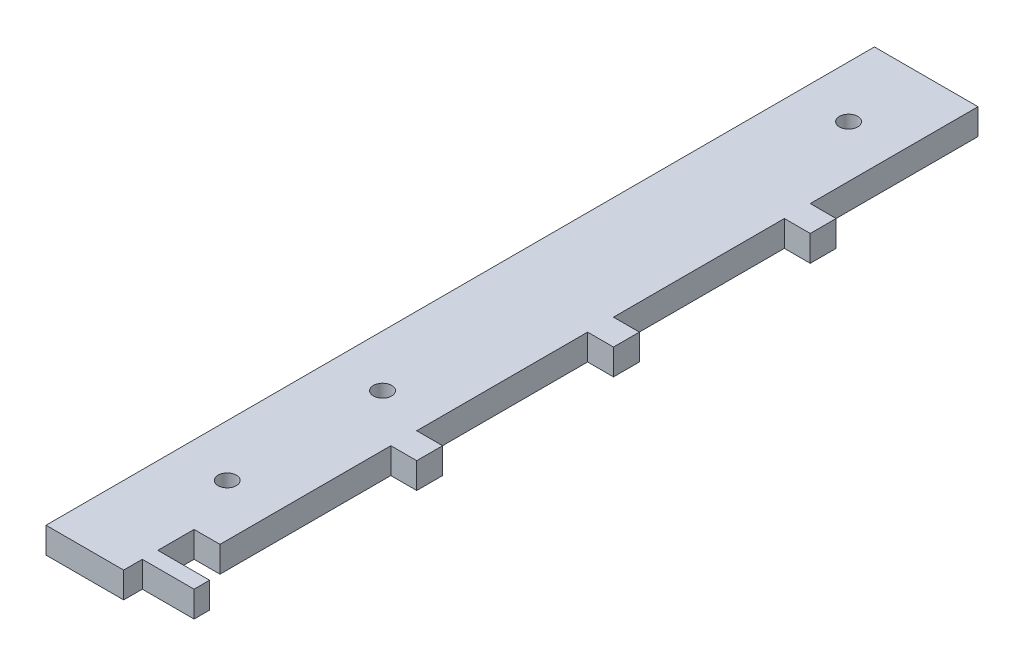
ISO-10303-21;
HEADER;
FILE_DESCRIPTION(('STEP AP214'),'2;1');
FILE_NAME('part.step','',(''),(''),'','','');
FILE_SCHEMA(('AUTOMOTIVE_DESIGN { 1 0 10303 214 1 1 1 1 }'));
ENDSEC;
DATA;
#1=APPLICATION_CONTEXT('core data for automotive mechanical design processes');
#2=APPLICATION_PROTOCOL_DEFINITION('international standard','automotive_design',2000,#1);
#3=PRODUCT_CONTEXT('',#1,'mechanical');
#4=PRODUCT('Part','Part','',(#3));
#5=PRODUCT_RELATED_PRODUCT_CATEGORY('part','',(#4));
#6=PRODUCT_DEFINITION_FORMATION('','',#4);
#7=PRODUCT_DEFINITION_CONTEXT('part definition',#1,'design');
#8=PRODUCT_DEFINITION('design','',#6,#7);
#9=PRODUCT_DEFINITION_SHAPE('','',#8);
#10=(LENGTH_UNIT() NAMED_UNIT(*) SI_UNIT(.MILLI.,.METRE.));
#11=(NAMED_UNIT(*) PLANE_ANGLE_UNIT() SI_UNIT($,.RADIAN.));
#12=(NAMED_UNIT(*) SI_UNIT($,.STERADIAN.) SOLID_ANGLE_UNIT());
#13=UNCERTAINTY_MEASURE_WITH_UNIT(LENGTH_MEASURE(1.E-05),#10,'distance_accuracy_value','');
#14=(GEOMETRIC_REPRESENTATION_CONTEXT(3) GLOBAL_UNCERTAINTY_ASSIGNED_CONTEXT((#13)) GLOBAL_UNIT_ASSIGNED_CONTEXT((#10,
#11,#12)) REPRESENTATION_CONTEXT('',''));
#15=CARTESIAN_POINT('',(0.,0.,0.));
#16=DIRECTION('',(0.,0.,1.));
#17=DIRECTION('',(1.,0.,0.));
#18=AXIS2_PLACEMENT_3D('',#15,#16,#17);
#19=CARTESIAN_POINT('',(0.,6.35,0.));
#20=DIRECTION('',(0.,0.,-1.));
#21=DIRECTION('',(-1.,0.,0.));
#22=AXIS2_PLACEMENT_3D('',#19,#20,#21);
#23=PLANE('',#22);
#24=DIRECTION('',(0.,1.,0.));
#25=VECTOR('',#24,1.);
#26=CARTESIAN_POINT('',(19.05,0.,0.));
#27=LINE('',#26,#25);
#28=CARTESIAN_POINT('',(19.05,0.,0.));
#29=VERTEX_POINT('',#28);
#30=CARTESIAN_POINT('',(19.05,6.35,0.));
#31=VERTEX_POINT('',#30);
#32=EDGE_CURVE('E182',#29,#31,#27,.T.);
#33=ORIENTED_EDGE('',*,*,#32,.T.);
#34=DIRECTION('',(1.,0.,0.));
#35=VECTOR('',#34,1.);
#36=CARTESIAN_POINT('',(0.,6.35,0.));
#37=LINE('',#36,#35);
#38=CARTESIAN_POINT('',(0.,6.35,0.));
#39=VERTEX_POINT('',#38);
#40=EDGE_CURVE('E233',#39,#31,#37,.T.);
#41=ORIENTED_EDGE('',*,*,#40,.F.);
#42=DIRECTION('',(0.,-1.,0.));
#43=VECTOR('',#42,1.);
#44=CARTESIAN_POINT('',(0.,6.35,0.));
#45=LINE('',#44,#43);
#46=CARTESIAN_POINT('',(0.,0.,0.));
#47=VERTEX_POINT('',#46);
#48=EDGE_CURVE('E11',#39,#47,#45,.T.);
#49=ORIENTED_EDGE('',*,*,#48,.T.);
#50=DIRECTION('',(1.,0.,0.));
#51=VECTOR('',#50,1.);
#52=CARTESIAN_POINT('',(0.,0.,0.));
#53=LINE('',#52,#51);
#54=EDGE_CURVE('E198',#47,#29,#53,.T.);
#55=ORIENTED_EDGE('',*,*,#54,.T.);
#56=EDGE_LOOP('',(#33,#41,#49,#55));
#57=FACE_BOUND('',#56,.T.);
#58=ADVANCED_FACE('F33',(#57),#23,.F.);
#59=CARTESIAN_POINT('',(31.75,6.35,0.));
#60=DIRECTION('',(-1.,0.,0.));
#61=DIRECTION('',(0.,0.,1.));
#62=AXIS2_PLACEMENT_3D('',#59,#60,#61);
#63=PLANE('',#62);
#64=DIRECTION('',(0.,1.,0.));
#65=VECTOR('',#64,1.);
#66=CARTESIAN_POINT('',(31.75,0.,-113.792));
#67=LINE('',#66,#65);
#68=CARTESIAN_POINT('',(31.75,0.,-113.792));
#69=VERTEX_POINT('',#68);
#70=CARTESIAN_POINT('',(31.75,6.35,-113.792));
#71=VERTEX_POINT('',#70);
#72=EDGE_CURVE('E344',#69,#71,#67,.T.);
#73=ORIENTED_EDGE('',*,*,#72,.T.);
#74=DIRECTION('',(0.,0.,-1.));
#75=VECTOR('',#74,1.);
#76=CARTESIAN_POINT('',(31.75,6.35,0.));
#77=LINE('',#76,#75);
#78=CARTESIAN_POINT('',(31.75,6.35,-107.442));
#79=VERTEX_POINT('',#78);
#80=EDGE_CURVE('E232',#79,#71,#77,.T.);
#81=ORIENTED_EDGE('',*,*,#80,.F.);
#82=DIRECTION('',(0.,1.,0.));
#83=VECTOR('',#82,1.);
#84=CARTESIAN_POINT('',(31.75,0.,-107.442));
#85=LINE('',#84,#83);
#86=CARTESIAN_POINT('',(31.75,0.,-107.442));
#87=VERTEX_POINT('',#86);
#88=EDGE_CURVE('E268',#87,#79,#85,.T.);
#89=ORIENTED_EDGE('',*,*,#88,.F.);
#90=DIRECTION('',(0.,0.,-1.));
#91=VECTOR('',#90,1.);
#92=CARTESIAN_POINT('',(31.75,0.,0.));
#93=LINE('',#92,#91);
#94=EDGE_CURVE('E208',#87,#69,#93,.T.);
#95=ORIENTED_EDGE('',*,*,#94,.T.);
#96=EDGE_LOOP('',(#73,#81,#89,#95));
#97=FACE_BOUND('',#96,.T.);
#98=ADVANCED_FACE('F418',(#97),#63,.F.);
#99=CARTESIAN_POINT('',(31.75,6.35,-155.702));
#100=VERTEX_POINT('',#99);
#101=CARTESIAN_POINT('',(31.75,6.35,-162.052));
#102=VERTEX_POINT('',#101);
#103=EDGE_CURVE('E229',#100,#102,#77,.T.);
#104=ORIENTED_EDGE('',*,*,#103,.F.);
#105=DIRECTION('',(0.,1.,0.));
#106=VECTOR('',#105,1.);
#107=CARTESIAN_POINT('',(31.75,0.,-155.702));
#108=LINE('',#107,#106);
#109=CARTESIAN_POINT('',(31.75,0.,-155.702));
#110=VERTEX_POINT('',#109);
#111=EDGE_CURVE('E318',#110,#100,#108,.T.);
#112=ORIENTED_EDGE('',*,*,#111,.F.);
#113=CARTESIAN_POINT('',(31.75,0.,-162.052));
#114=VERTEX_POINT('',#113);
#115=EDGE_CURVE('E204',#110,#114,#93,.T.);
#116=ORIENTED_EDGE('',*,*,#115,.T.);
#117=DIRECTION('',(0.,1.,0.));
#118=VECTOR('',#117,1.);
#119=CARTESIAN_POINT('',(31.75,0.,-162.052));
#120=LINE('',#119,#118);
#121=EDGE_CURVE('E294',#114,#102,#120,.T.);
#122=ORIENTED_EDGE('',*,*,#121,.T.);
#123=EDGE_LOOP('',(#104,#112,#116,#122));
#124=FACE_BOUND('',#123,.T.);
#125=ADVANCED_FACE('F422',(#124),#63,.F.);
#126=DIRECTION('',(0.,1.,0.));
#127=VECTOR('',#126,1.);
#128=CARTESIAN_POINT('',(31.75,0.,-65.532));
#129=LINE('',#128,#127);
#130=CARTESIAN_POINT('',(31.75,0.,-65.532));
#131=VERTEX_POINT('',#130);
#132=CARTESIAN_POINT('',(31.75,6.35,-65.532));
#133=VERTEX_POINT('',#132);
#134=EDGE_CURVE('E301',#131,#133,#129,.T.);
#135=ORIENTED_EDGE('',*,*,#134,.T.);
#136=CARTESIAN_POINT('',(31.75,6.35,-59.182));
#137=VERTEX_POINT('',#136);
#138=EDGE_CURVE('E227',#137,#133,#77,.T.);
#139=ORIENTED_EDGE('',*,*,#138,.F.);
#140=DIRECTION('',(0.,1.,0.));
#141=VECTOR('',#140,1.);
#142=CARTESIAN_POINT('',(31.75,0.,-59.182));
#143=LINE('',#142,#141);
#144=CARTESIAN_POINT('',(31.75,0.,-59.182));
#145=VERTEX_POINT('',#144);
#146=EDGE_CURVE('E250',#145,#137,#143,.T.);
#147=ORIENTED_EDGE('',*,*,#146,.F.);
#148=EDGE_CURVE('E517',#145,#131,#93,.T.);
#149=ORIENTED_EDGE('',*,*,#148,.T.);
#150=EDGE_LOOP('',(#135,#139,#147,#149));
#151=FACE_BOUND('',#150,.T.);
#152=ADVANCED_FACE('F536',(#151),#63,.F.);
#153=CARTESIAN_POINT('',(31.75,6.35,-4.572));
#154=VERTEX_POINT('',#153);
#155=CARTESIAN_POINT('',(31.75,6.35,-8.382));
#156=VERTEX_POINT('',#155);
#157=EDGE_CURVE('E221',#154,#156,#77,.T.);
#158=ORIENTED_EDGE('',*,*,#157,.F.);
#159=DIRECTION('',(0.,1.,0.));
#160=VECTOR('',#159,1.);
#161=CARTESIAN_POINT('',(31.75,0.,-4.572));
#162=LINE('',#161,#160);
#163=CARTESIAN_POINT('',(31.75,0.,-4.572));
#164=VERTEX_POINT('',#163);
#165=EDGE_CURVE('E192',#164,#154,#162,.T.);
#166=ORIENTED_EDGE('',*,*,#165,.F.);
#167=CARTESIAN_POINT('',(31.75,0.,-8.382));
#168=VERTEX_POINT('',#167);
#169=EDGE_CURVE('E210',#164,#168,#93,.T.);
#170=ORIENTED_EDGE('',*,*,#169,.T.);
#171=DIRECTION('',(0.,1.,0.));
#172=VECTOR('',#171,1.);
#173=CARTESIAN_POINT('',(31.75,0.,-8.382));
#174=LINE('',#173,#172);
#175=EDGE_CURVE('E247',#168,#156,#174,.T.);
#176=ORIENTED_EDGE('',*,*,#175,.T.);
#177=EDGE_LOOP('',(#158,#166,#170,#176));
#178=FACE_BOUND('',#177,.T.);
#179=ADVANCED_FACE('F425',(#178),#63,.F.);
#180=CARTESIAN_POINT('',(0.,6.35,0.));
#181=DIRECTION('',(0.,-1.,0.));
#182=DIRECTION('',(0.,0.,-1.));
#183=AXIS2_PLACEMENT_3D('',#180,#181,#182);
#184=PLANE('',#183);
#185=CARTESIAN_POINT('',(12.7,6.35,-31.75));
#186=DIRECTION('',(0.,-1.,0.));
#187=DIRECTION('',(0.,0.,-1.));
#188=AXIS2_PLACEMENT_3D('',#185,#186,#187);
#189=CIRCLE('',#188,2.2479);
#190=CARTESIAN_POINT('',(12.7,6.35,-33.9979));
#191=VERTEX_POINT('',#190);
#192=EDGE_CURVE('E377',#191,#191,#189,.T.);
#193=ORIENTED_EDGE('',*,*,#192,.T.);
#194=EDGE_LOOP('',(#193));
#195=FACE_BOUND('',#194,.T.);
#196=CARTESIAN_POINT('',(12.7,6.35,-69.85));
#197=DIRECTION('',(0.,-1.,0.));
#198=DIRECTION('',(0.,0.,-1.));
#199=AXIS2_PLACEMENT_3D('',#196,#197,#198);
#200=CIRCLE('',#199,2.2479);
#201=CARTESIAN_POINT('',(12.7,6.35,-72.0979));
#202=VERTEX_POINT('',#201);
#203=EDGE_CURVE('E365',#202,#202,#200,.T.);
#204=ORIENTED_EDGE('',*,*,#203,.T.);
#205=EDGE_LOOP('',(#204));
#206=FACE_BOUND('',#205,.T.);
#207=CARTESIAN_POINT('',(12.7,6.35,-184.15));
#208=DIRECTION('',(0.,-1.,0.));
#209=DIRECTION('',(0.,0.,-1.));
#210=AXIS2_PLACEMENT_3D('',#207,#208,#209);
#211=CIRCLE('',#210,2.2479);
#212=CARTESIAN_POINT('',(12.7,6.35,-186.3979));
#213=VERTEX_POINT('',#212);
#214=EDGE_CURVE('E253',#213,#213,#211,.T.);
#215=ORIENTED_EDGE('',*,*,#214,.T.);
#216=EDGE_LOOP('',(#215));
#217=FACE_BOUND('',#216,.T.);
#218=DIRECTION('',(0.,0.,-1.));
#219=VECTOR('',#218,1.);
#220=CARTESIAN_POINT('',(19.05,6.35,0.));
#221=LINE('',#220,#219);
#222=CARTESIAN_POINT('',(19.05,6.35,-4.572));
#223=VERTEX_POINT('',#222);
#224=EDGE_CURVE('E188',#31,#223,#221,.T.);
#225=ORIENTED_EDGE('',*,*,#224,.T.);
#226=DIRECTION('',(-1.,0.,0.));
#227=VECTOR('',#226,1.);
#228=CARTESIAN_POINT('',(0.,6.35,-4.572));
#229=LINE('',#228,#227);
#230=EDGE_CURVE('E200',#154,#223,#229,.T.);
#231=ORIENTED_EDGE('',*,*,#230,.F.);
#232=ORIENTED_EDGE('',*,*,#157,.T.);
#233=DIRECTION('',(-1.,0.,0.));
#234=VECTOR('',#233,1.);
#235=CARTESIAN_POINT('',(31.75,6.35,-8.382));
#236=LINE('',#235,#234);
#237=CARTESIAN_POINT('',(19.05,6.35,-8.382));
#238=VERTEX_POINT('',#237);
#239=EDGE_CURVE('E259',#156,#238,#236,.T.);
#240=ORIENTED_EDGE('',*,*,#239,.T.);
#241=DIRECTION('',(0.,0.,-1.));
#242=VECTOR('',#241,1.);
#243=CARTESIAN_POINT('',(19.05,6.35,-8.382));
#244=LINE('',#243,#242);
#245=CARTESIAN_POINT('',(19.05,6.35,-17.272));
#246=VERTEX_POINT('',#245);
#247=EDGE_CURVE('E269',#238,#246,#244,.T.);
#248=ORIENTED_EDGE('',*,*,#247,.T.);
#249=DIRECTION('',(-1.,0.,0.));
#250=VECTOR('',#249,1.);
#251=CARTESIAN_POINT('',(31.75,6.35,-17.272));
#252=LINE('',#251,#250);
#253=CARTESIAN_POINT('',(25.4,6.35,-17.272));
#254=VERTEX_POINT('',#253);
#255=EDGE_CURVE('E266',#254,#246,#252,.T.);
#256=ORIENTED_EDGE('',*,*,#255,.F.);
#257=DIRECTION('',(0.,0.,1.));
#258=VECTOR('',#257,1.);
#259=CARTESIAN_POINT('',(25.4,6.35,0.));
#260=LINE('',#259,#258);
#261=CARTESIAN_POINT('',(25.4,6.35,-59.182));
#262=VERTEX_POINT('',#261);
#263=EDGE_CURVE('E239',#262,#254,#260,.T.);
#264=ORIENTED_EDGE('',*,*,#263,.F.);
#265=DIRECTION('',(-1.,0.,0.));
#266=VECTOR('',#265,1.);
#267=CARTESIAN_POINT('',(0.,6.35,-59.182));
#268=LINE('',#267,#266);
#269=EDGE_CURVE('E244',#137,#262,#268,.T.);
#270=ORIENTED_EDGE('',*,*,#269,.F.);
#271=ORIENTED_EDGE('',*,*,#138,.T.);
#272=DIRECTION('',(-1.,0.,0.));
#273=VECTOR('',#272,1.);
#274=CARTESIAN_POINT('',(0.,6.35,-65.532));
#275=LINE('',#274,#273);
#276=CARTESIAN_POINT('',(25.4,6.35,-65.532));
#277=VERTEX_POINT('',#276);
#278=EDGE_CURVE('E283',#133,#277,#275,.T.);
#279=ORIENTED_EDGE('',*,*,#278,.T.);
#280=DIRECTION('',(0.,0.,1.));
#281=VECTOR('',#280,1.);
#282=CARTESIAN_POINT('',(25.4,6.35,0.));
#283=LINE('',#282,#281);
#284=CARTESIAN_POINT('',(25.4,6.35,-107.442));
#285=VERTEX_POINT('',#284);
#286=EDGE_CURVE('E295',#285,#277,#283,.T.);
#287=ORIENTED_EDGE('',*,*,#286,.F.);
#288=DIRECTION('',(-1.,0.,0.));
#289=VECTOR('',#288,1.);
#290=CARTESIAN_POINT('',(0.,6.35,-107.442));
#291=LINE('',#290,#289);
#292=EDGE_CURVE('E291',#79,#285,#291,.T.);
#293=ORIENTED_EDGE('',*,*,#292,.F.);
#294=ORIENTED_EDGE('',*,*,#80,.T.);
#295=DIRECTION('',(-1.,0.,0.));
#296=VECTOR('',#295,1.);
#297=CARTESIAN_POINT('',(31.75,6.35,-113.792));
#298=LINE('',#297,#296);
#299=CARTESIAN_POINT('',(25.4,6.35,-113.792));
#300=VERTEX_POINT('',#299);
#301=EDGE_CURVE('E329',#71,#300,#298,.T.);
#302=ORIENTED_EDGE('',*,*,#301,.T.);
#303=DIRECTION('',(0.,0.,1.));
#304=VECTOR('',#303,1.);
#305=CARTESIAN_POINT('',(25.4,6.35,-155.702));
#306=LINE('',#305,#304);
#307=CARTESIAN_POINT('',(25.4,6.35,-155.702));
#308=VERTEX_POINT('',#307);
#309=EDGE_CURVE('E339',#308,#300,#306,.T.);
#310=ORIENTED_EDGE('',*,*,#309,.F.);
#311=DIRECTION('',(-1.,0.,0.));
#312=VECTOR('',#311,1.);
#313=CARTESIAN_POINT('',(31.75,6.35,-155.702));
#314=LINE('',#313,#312);
#315=EDGE_CURVE('E336',#100,#308,#314,.T.);
#316=ORIENTED_EDGE('',*,*,#315,.F.);
#317=ORIENTED_EDGE('',*,*,#103,.T.);
#318=DIRECTION('',(-1.,0.,0.));
#319=VECTOR('',#318,1.);
#320=CARTESIAN_POINT('',(0.,6.35,-162.052));
#321=LINE('',#320,#319);
#322=CARTESIAN_POINT('',(25.4,6.35,-162.052));
#323=VERTEX_POINT('',#322);
#324=EDGE_CURVE('E310',#102,#323,#321,.T.);
#325=ORIENTED_EDGE('',*,*,#324,.T.);
#326=DIRECTION('',(0.,0.,1.));
#327=VECTOR('',#326,1.);
#328=CARTESIAN_POINT('',(25.4,6.35,0.));
#329=LINE('',#328,#327);
#330=CARTESIAN_POINT('',(25.4,6.35,-203.2));
#331=VERTEX_POINT('',#330);
#332=EDGE_CURVE('E315',#331,#323,#329,.T.);
#333=ORIENTED_EDGE('',*,*,#332,.F.);
#334=DIRECTION('',(-1.,0.,0.));
#335=VECTOR('',#334,1.);
#336=CARTESIAN_POINT('',(0.,6.35,-203.2));
#337=LINE('',#336,#335);
#338=CARTESIAN_POINT('',(0.,6.35,-203.2));
#339=VERTEX_POINT('',#338);
#340=EDGE_CURVE('E217',#331,#339,#337,.T.);
#341=ORIENTED_EDGE('',*,*,#340,.T.);
#342=DIRECTION('',(0.,0.,1.));
#343=VECTOR('',#342,1.);
#344=CARTESIAN_POINT('',(0.,6.35,0.));
#345=LINE('',#344,#343);
#346=EDGE_CURVE('E215',#339,#39,#345,.T.);
#347=ORIENTED_EDGE('',*,*,#346,.T.);
#348=ORIENTED_EDGE('',*,*,#40,.T.);
#349=EDGE_LOOP('',(#225,#231,#232,#240,#248,#256,#264,#270,#271,#279,#287,#293,#294,#302,#310,
#316,#317,#325,#333,#341,#347,#348));
#350=FACE_BOUND('',#349,.T.);
#351=ADVANCED_FACE('F394',(#195,#206,#217,#350),#184,.F.);
#352=CARTESIAN_POINT('',(0.,0.,0.));
#353=DIRECTION('',(0.,-1.,0.));
#354=DIRECTION('',(0.,0.,-1.));
#355=AXIS2_PLACEMENT_3D('',#352,#353,#354);
#356=PLANE('',#355);
#357=CARTESIAN_POINT('',(12.7,0.,-31.75));
#358=DIRECTION('',(0.,-1.,0.));
#359=DIRECTION('',(0.,0.,-1.));
#360=AXIS2_PLACEMENT_3D('',#357,#358,#359);
#361=CIRCLE('',#360,4.76249999999999);
#362=CARTESIAN_POINT('',(12.7,0.,-36.5125));
#363=VERTEX_POINT('',#362);
#364=EDGE_CURVE('E386',#363,#363,#361,.T.);
#365=ORIENTED_EDGE('',*,*,#364,.F.);
#366=EDGE_LOOP('',(#365));
#367=FACE_BOUND('',#366,.T.);
#368=CARTESIAN_POINT('',(12.7,0.,-69.85));
#369=DIRECTION('',(0.,-1.,0.));
#370=DIRECTION('',(0.,0.,-1.));
#371=AXIS2_PLACEMENT_3D('',#368,#369,#370);
#372=CIRCLE('',#371,4.76249999999999);
#373=CARTESIAN_POINT('',(12.7,0.,-74.6125));
#374=VERTEX_POINT('',#373);
#375=EDGE_CURVE('E374',#374,#374,#372,.T.);
#376=ORIENTED_EDGE('',*,*,#375,.F.);
#377=EDGE_LOOP('',(#376));
#378=FACE_BOUND('',#377,.T.);
#379=CARTESIAN_POINT('',(12.7,0.,-184.15));
#380=DIRECTION('',(0.,-1.,0.));
#381=DIRECTION('',(0.,0.,-1.));
#382=AXIS2_PLACEMENT_3D('',#379,#380,#381);
#383=CIRCLE('',#382,4.76249999999999);
#384=CARTESIAN_POINT('',(12.7,0.,-188.9125));
#385=VERTEX_POINT('',#384);
#386=EDGE_CURVE('E362',#385,#385,#383,.T.);
#387=ORIENTED_EDGE('',*,*,#386,.F.);
#388=EDGE_LOOP('',(#387));
#389=FACE_BOUND('',#388,.T.);
#390=DIRECTION('',(-1.,0.,0.));
#391=VECTOR('',#390,1.);
#392=CARTESIAN_POINT('',(0.,0.,-4.572));
#393=LINE('',#392,#391);
#394=CARTESIAN_POINT('',(19.05,0.,-4.572));
#395=VERTEX_POINT('',#394);
#396=EDGE_CURVE('E193',#164,#395,#393,.T.);
#397=ORIENTED_EDGE('',*,*,#396,.T.);
#398=DIRECTION('',(0.,0.,-1.));
#399=VECTOR('',#398,1.);
#400=CARTESIAN_POINT('',(19.05,0.,0.));
#401=LINE('',#400,#399);
#402=EDGE_CURVE('E185',#29,#395,#401,.T.);
#403=ORIENTED_EDGE('',*,*,#402,.F.);
#404=ORIENTED_EDGE('',*,*,#54,.F.);
#405=DIRECTION('',(0.,0.,1.));
#406=VECTOR('',#405,1.);
#407=CARTESIAN_POINT('',(0.,0.,0.));
#408=LINE('',#407,#406);
#409=CARTESIAN_POINT('',(0.,0.,-203.2));
#410=VERTEX_POINT('',#409);
#411=EDGE_CURVE('E205',#410,#47,#408,.T.);
#412=ORIENTED_EDGE('',*,*,#411,.F.);
#413=DIRECTION('',(-1.,0.,0.));
#414=VECTOR('',#413,1.);
#415=CARTESIAN_POINT('',(0.,0.,-203.2));
#416=LINE('',#415,#414);
#417=CARTESIAN_POINT('',(25.4,0.,-203.2));
#418=VERTEX_POINT('',#417);
#419=EDGE_CURVE('E214',#418,#410,#416,.T.);
#420=ORIENTED_EDGE('',*,*,#419,.F.);
#421=DIRECTION('',(0.,0.,1.));
#422=VECTOR('',#421,1.);
#423=CARTESIAN_POINT('',(25.4,0.,0.));
#424=LINE('',#423,#422);
#425=CARTESIAN_POINT('',(25.4,0.,-162.052));
#426=VERTEX_POINT('',#425);
#427=EDGE_CURVE('E307',#418,#426,#424,.T.);
#428=ORIENTED_EDGE('',*,*,#427,.T.);
#429=DIRECTION('',(-1.,0.,0.));
#430=VECTOR('',#429,1.);
#431=CARTESIAN_POINT('',(0.,0.,-162.052));
#432=LINE('',#431,#430);
#433=EDGE_CURVE('E311',#114,#426,#432,.T.);
#434=ORIENTED_EDGE('',*,*,#433,.F.);
#435=ORIENTED_EDGE('',*,*,#115,.F.);
#436=DIRECTION('',(-1.,0.,0.));
#437=VECTOR('',#436,1.);
#438=CARTESIAN_POINT('',(31.75,0.,-155.702));
#439=LINE('',#438,#437);
#440=CARTESIAN_POINT('',(25.4,0.,-155.702));
#441=VERTEX_POINT('',#440);
#442=EDGE_CURVE('E326',#110,#441,#439,.T.);
#443=ORIENTED_EDGE('',*,*,#442,.T.);
#444=DIRECTION('',(0.,0.,1.));
#445=VECTOR('',#444,1.);
#446=CARTESIAN_POINT('',(25.4,0.,-155.702));
#447=LINE('',#446,#445);
#448=CARTESIAN_POINT('',(25.4,0.,-113.792));
#449=VERTEX_POINT('',#448);
#450=EDGE_CURVE('E330',#441,#449,#447,.T.);
#451=ORIENTED_EDGE('',*,*,#450,.T.);
#452=DIRECTION('',(-1.,0.,0.));
#453=VECTOR('',#452,1.);
#454=CARTESIAN_POINT('',(31.75,0.,-113.792));
#455=LINE('',#454,#453);
#456=EDGE_CURVE('E333',#69,#449,#455,.T.);
#457=ORIENTED_EDGE('',*,*,#456,.F.);
#458=ORIENTED_EDGE('',*,*,#94,.F.);
#459=DIRECTION('',(-1.,0.,0.));
#460=VECTOR('',#459,1.);
#461=CARTESIAN_POINT('',(0.,0.,-107.442));
#462=LINE('',#461,#460);
#463=CARTESIAN_POINT('',(25.4,0.,-107.442));
#464=VERTEX_POINT('',#463);
#465=EDGE_CURVE('E280',#87,#464,#462,.T.);
#466=ORIENTED_EDGE('',*,*,#465,.T.);
#467=DIRECTION('',(0.,0.,1.));
#468=VECTOR('',#467,1.);
#469=CARTESIAN_POINT('',(25.4,0.,0.));
#470=LINE('',#469,#468);
#471=CARTESIAN_POINT('',(25.4,0.,-65.532));
#472=VERTEX_POINT('',#471);
#473=EDGE_CURVE('E284',#464,#472,#470,.T.);
#474=ORIENTED_EDGE('',*,*,#473,.T.);
#475=DIRECTION('',(-1.,0.,0.));
#476=VECTOR('',#475,1.);
#477=CARTESIAN_POINT('',(0.,0.,-65.532));
#478=LINE('',#477,#476);
#479=EDGE_CURVE('E287',#131,#472,#478,.T.);
#480=ORIENTED_EDGE('',*,*,#479,.F.);
#481=ORIENTED_EDGE('',*,*,#148,.F.);
#482=DIRECTION('',(-1.,0.,0.));
#483=VECTOR('',#482,1.);
#484=CARTESIAN_POINT('',(0.,0.,-59.182));
#485=LINE('',#484,#483);
#486=CARTESIAN_POINT('',(25.4,0.,-59.182));
#487=VERTEX_POINT('',#486);
#488=EDGE_CURVE('E236',#145,#487,#485,.T.);
#489=ORIENTED_EDGE('',*,*,#488,.T.);
#490=DIRECTION('',(0.,0.,1.));
#491=VECTOR('',#490,1.);
#492=CARTESIAN_POINT('',(25.4,0.,0.));
#493=LINE('',#492,#491);
#494=CARTESIAN_POINT('',(25.4,0.,-17.272));
#495=VERTEX_POINT('',#494);
#496=EDGE_CURVE('E240',#487,#495,#493,.T.);
#497=ORIENTED_EDGE('',*,*,#496,.T.);
#498=DIRECTION('',(-1.,0.,0.));
#499=VECTOR('',#498,1.);
#500=CARTESIAN_POINT('',(31.75,0.,-17.272));
#501=LINE('',#500,#499);
#502=CARTESIAN_POINT('',(19.05,0.,-17.272));
#503=VERTEX_POINT('',#502);
#504=EDGE_CURVE('E256',#495,#503,#501,.T.);
#505=ORIENTED_EDGE('',*,*,#504,.T.);
#506=DIRECTION('',(0.,0.,-1.));
#507=VECTOR('',#506,1.);
#508=CARTESIAN_POINT('',(19.05,0.,-8.382));
#509=LINE('',#508,#507);
#510=CARTESIAN_POINT('',(19.05,0.,-8.382));
#511=VERTEX_POINT('',#510);
#512=EDGE_CURVE('E260',#511,#503,#509,.T.);
#513=ORIENTED_EDGE('',*,*,#512,.F.);
#514=DIRECTION('',(-1.,0.,0.));
#515=VECTOR('',#514,1.);
#516=CARTESIAN_POINT('',(31.75,0.,-8.382));
#517=LINE('',#516,#515);
#518=EDGE_CURVE('E263',#168,#511,#517,.T.);
#519=ORIENTED_EDGE('',*,*,#518,.F.);
#520=ORIENTED_EDGE('',*,*,#169,.F.);
#521=EDGE_LOOP('',(#397,#403,#404,#412,#420,#428,#434,#435,#443,#451,#457,#458,#466,#474,#480,
#481,#489,#497,#505,#513,#519,#520));
#522=FACE_BOUND('',#521,.T.);
#523=ADVANCED_FACE('F196',(#367,#378,#389,#522),#356,.T.);
#524=CARTESIAN_POINT('',(0.,6.35,0.));
#525=DIRECTION('',(1.,0.,0.));
#526=DIRECTION('',(0.,0.,-1.));
#527=AXIS2_PLACEMENT_3D('',#524,#525,#526);
#528=PLANE('',#527);
#529=ORIENTED_EDGE('',*,*,#411,.T.);
#530=ORIENTED_EDGE('',*,*,#48,.F.);
#531=ORIENTED_EDGE('',*,*,#346,.F.);
#532=DIRECTION('',(0.,-1.,0.));
#533=VECTOR('',#532,1.);
#534=CARTESIAN_POINT('',(0.,6.35,-203.2));
#535=LINE('',#534,#533);
#536=EDGE_CURVE('E41',#339,#410,#535,.T.);
#537=ORIENTED_EDGE('',*,*,#536,.T.);
#538=EDGE_LOOP('',(#529,#530,#531,#537));
#539=FACE_BOUND('',#538,.T.);
#540=ADVANCED_FACE('F35',(#539),#528,.F.);
#541=CARTESIAN_POINT('',(0.,6.35,-203.2));
#542=DIRECTION('',(0.,0.,1.));
#543=DIRECTION('',(1.,0.,0.));
#544=AXIS2_PLACEMENT_3D('',#541,#542,#543);
#545=PLANE('',#544);
#546=ORIENTED_EDGE('',*,*,#340,.F.);
#547=DIRECTION('',(0.,1.,0.));
#548=VECTOR('',#547,1.);
#549=CARTESIAN_POINT('',(25.4,0.,-203.2));
#550=LINE('',#549,#548);
#551=EDGE_CURVE('E314',#418,#331,#550,.T.);
#552=ORIENTED_EDGE('',*,*,#551,.F.);
#553=ORIENTED_EDGE('',*,*,#419,.T.);
#554=ORIENTED_EDGE('',*,*,#536,.F.);
#555=EDGE_LOOP('',(#546,#552,#553,#554));
#556=FACE_BOUND('',#555,.T.);
#557=ADVANCED_FACE('F427',(#556),#545,.F.);
#558=CARTESIAN_POINT('',(0.,0.,-59.182));
#559=DIRECTION('',(0.,0.,-1.));
#560=DIRECTION('',(-1.,0.,0.));
#561=AXIS2_PLACEMENT_3D('',#558,#559,#560);
#562=PLANE('',#561);
#563=ORIENTED_EDGE('',*,*,#269,.T.);
#564=DIRECTION('',(0.,1.,0.));
#565=VECTOR('',#564,1.);
#566=CARTESIAN_POINT('',(25.4,0.,-59.182));
#567=LINE('',#566,#565);
#568=EDGE_CURVE('E243',#487,#262,#567,.T.);
#569=ORIENTED_EDGE('',*,*,#568,.F.);
#570=ORIENTED_EDGE('',*,*,#488,.F.);
#571=ORIENTED_EDGE('',*,*,#146,.T.);
#572=EDGE_LOOP('',(#563,#569,#570,#571));
#573=FACE_BOUND('',#572,.T.);
#574=ADVANCED_FACE('F429',(#573),#562,.F.);
#575=CARTESIAN_POINT('',(25.4,0.,0.));
#576=DIRECTION('',(-1.,0.,0.));
#577=DIRECTION('',(0.,0.,1.));
#578=AXIS2_PLACEMENT_3D('',#575,#576,#577);
#579=PLANE('',#578);
#580=ORIENTED_EDGE('',*,*,#263,.T.);
#581=DIRECTION('',(0.,1.,0.));
#582=VECTOR('',#581,1.);
#583=CARTESIAN_POINT('',(25.4,0.,-17.272));
#584=LINE('',#583,#582);
#585=EDGE_CURVE('E252',#495,#254,#584,.T.);
#586=ORIENTED_EDGE('',*,*,#585,.F.);
#587=ORIENTED_EDGE('',*,*,#496,.F.);
#588=ORIENTED_EDGE('',*,*,#568,.T.);
#589=EDGE_LOOP('',(#580,#586,#587,#588));
#590=FACE_BOUND('',#589,.T.);
#591=ADVANCED_FACE('F435',(#590),#579,.F.);
#592=CARTESIAN_POINT('',(31.75,0.,-8.382));
#593=DIRECTION('',(0.,0.,-1.));
#594=DIRECTION('',(-1.,0.,0.));
#595=AXIS2_PLACEMENT_3D('',#592,#593,#594);
#596=PLANE('',#595);
#597=ORIENTED_EDGE('',*,*,#239,.F.);
#598=ORIENTED_EDGE('',*,*,#175,.F.);
#599=ORIENTED_EDGE('',*,*,#518,.T.);
#600=DIRECTION('',(0.,1.,0.));
#601=VECTOR('',#600,1.);
#602=CARTESIAN_POINT('',(19.05,0.,-8.382));
#603=LINE('',#602,#601);
#604=EDGE_CURVE('E276',#511,#238,#603,.T.);
#605=ORIENTED_EDGE('',*,*,#604,.T.);
#606=EDGE_LOOP('',(#597,#598,#599,#605));
#607=FACE_BOUND('',#606,.T.);
#608=ADVANCED_FACE('F438',(#607),#596,.T.);
#609=CARTESIAN_POINT('',(19.05,0.,-8.382));
#610=DIRECTION('',(1.,0.,0.));
#611=DIRECTION('',(0.,0.,-1.));
#612=AXIS2_PLACEMENT_3D('',#609,#610,#611);
#613=PLANE('',#612);
#614=ORIENTED_EDGE('',*,*,#247,.F.);
#615=ORIENTED_EDGE('',*,*,#604,.F.);
#616=ORIENTED_EDGE('',*,*,#512,.T.);
#617=DIRECTION('',(0.,1.,0.));
#618=VECTOR('',#617,1.);
#619=CARTESIAN_POINT('',(19.05,0.,-17.272));
#620=LINE('',#619,#618);
#621=EDGE_CURVE('E265',#503,#246,#620,.T.);
#622=ORIENTED_EDGE('',*,*,#621,.T.);
#623=EDGE_LOOP('',(#614,#615,#616,#622));
#624=FACE_BOUND('',#623,.T.);
#625=ADVANCED_FACE('F446',(#624),#613,.T.);
#626=CARTESIAN_POINT('',(31.75,0.,-17.272));
#627=DIRECTION('',(0.,0.,-1.));
#628=DIRECTION('',(-1.,0.,0.));
#629=AXIS2_PLACEMENT_3D('',#626,#627,#628);
#630=PLANE('',#629);
#631=ORIENTED_EDGE('',*,*,#585,.T.);
#632=ORIENTED_EDGE('',*,*,#255,.T.);
#633=ORIENTED_EDGE('',*,*,#621,.F.);
#634=ORIENTED_EDGE('',*,*,#504,.F.);
#635=EDGE_LOOP('',(#631,#632,#633,#634));
#636=FACE_BOUND('',#635,.T.);
#637=ADVANCED_FACE('F440',(#636),#630,.F.);
#638=CARTESIAN_POINT('',(0.,0.,-107.442));
#639=DIRECTION('',(0.,0.,-1.));
#640=DIRECTION('',(-1.,0.,0.));
#641=AXIS2_PLACEMENT_3D('',#638,#639,#640);
#642=PLANE('',#641);
#643=ORIENTED_EDGE('',*,*,#292,.T.);
#644=DIRECTION('',(0.,1.,0.));
#645=VECTOR('',#644,1.);
#646=CARTESIAN_POINT('',(25.4,0.,-107.442));
#647=LINE('',#646,#645);
#648=EDGE_CURVE('E290',#464,#285,#647,.T.);
#649=ORIENTED_EDGE('',*,*,#648,.F.);
#650=ORIENTED_EDGE('',*,*,#465,.F.);
#651=ORIENTED_EDGE('',*,*,#88,.T.);
#652=EDGE_LOOP('',(#643,#649,#650,#651));
#653=FACE_BOUND('',#652,.T.);
#654=ADVANCED_FACE('F451',(#653),#642,.F.);
#655=CARTESIAN_POINT('',(0.,0.,-65.532));
#656=DIRECTION('',(0.,0.,-1.));
#657=DIRECTION('',(-1.,0.,0.));
#658=AXIS2_PLACEMENT_3D('',#655,#656,#657);
#659=PLANE('',#658);
#660=ORIENTED_EDGE('',*,*,#278,.F.);
#661=ORIENTED_EDGE('',*,*,#134,.F.);
#662=ORIENTED_EDGE('',*,*,#479,.T.);
#663=DIRECTION('',(0.,1.,0.));
#664=VECTOR('',#663,1.);
#665=CARTESIAN_POINT('',(25.4,0.,-65.532));
#666=LINE('',#665,#664);
#667=EDGE_CURVE('E304',#472,#277,#666,.T.);
#668=ORIENTED_EDGE('',*,*,#667,.T.);
#669=EDGE_LOOP('',(#660,#661,#662,#668));
#670=FACE_BOUND('',#669,.T.);
#671=ADVANCED_FACE('F455',(#670),#659,.T.);
#672=CARTESIAN_POINT('',(25.4,0.,0.));
#673=DIRECTION('',(-1.,0.,0.));
#674=DIRECTION('',(0.,0.,1.));
#675=AXIS2_PLACEMENT_3D('',#672,#673,#674);
#676=PLANE('',#675);
#677=ORIENTED_EDGE('',*,*,#286,.T.);
#678=ORIENTED_EDGE('',*,*,#667,.F.);
#679=ORIENTED_EDGE('',*,*,#473,.F.);
#680=ORIENTED_EDGE('',*,*,#648,.T.);
#681=EDGE_LOOP('',(#677,#678,#679,#680));
#682=FACE_BOUND('',#681,.T.);
#683=ADVANCED_FACE('F458',(#682),#676,.F.);
#684=CARTESIAN_POINT('',(0.,0.,-162.052));
#685=DIRECTION('',(0.,0.,-1.));
#686=DIRECTION('',(-1.,0.,0.));
#687=AXIS2_PLACEMENT_3D('',#684,#685,#686);
#688=PLANE('',#687);
#689=ORIENTED_EDGE('',*,*,#324,.F.);
#690=ORIENTED_EDGE('',*,*,#121,.F.);
#691=ORIENTED_EDGE('',*,*,#433,.T.);
#692=DIRECTION('',(0.,1.,0.));
#693=VECTOR('',#692,1.);
#694=CARTESIAN_POINT('',(25.4,0.,-162.052));
#695=LINE('',#694,#693);
#696=EDGE_CURVE('E323',#426,#323,#695,.T.);
#697=ORIENTED_EDGE('',*,*,#696,.T.);
#698=EDGE_LOOP('',(#689,#690,#691,#697));
#699=FACE_BOUND('',#698,.T.);
#700=ADVANCED_FACE('F462',(#699),#688,.T.);
#701=CARTESIAN_POINT('',(25.4,0.,0.));
#702=DIRECTION('',(-1.,0.,0.));
#703=DIRECTION('',(0.,0.,1.));
#704=AXIS2_PLACEMENT_3D('',#701,#702,#703);
#705=PLANE('',#704);
#706=ORIENTED_EDGE('',*,*,#332,.T.);
#707=ORIENTED_EDGE('',*,*,#696,.F.);
#708=ORIENTED_EDGE('',*,*,#427,.F.);
#709=ORIENTED_EDGE('',*,*,#551,.T.);
#710=EDGE_LOOP('',(#706,#707,#708,#709));
#711=FACE_BOUND('',#710,.T.);
#712=ADVANCED_FACE('F469',(#711),#705,.F.);
#713=CARTESIAN_POINT('',(31.75,0.,-155.702));
#714=DIRECTION('',(0.,0.,-1.));
#715=DIRECTION('',(-1.,0.,0.));
#716=AXIS2_PLACEMENT_3D('',#713,#714,#715);
#717=PLANE('',#716);
#718=ORIENTED_EDGE('',*,*,#315,.T.);
#719=DIRECTION('',(0.,1.,0.));
#720=VECTOR('',#719,1.);
#721=CARTESIAN_POINT('',(25.4,0.,-155.702));
#722=LINE('',#721,#720);
#723=EDGE_CURVE('E335',#441,#308,#722,.T.);
#724=ORIENTED_EDGE('',*,*,#723,.F.);
#725=ORIENTED_EDGE('',*,*,#442,.F.);
#726=ORIENTED_EDGE('',*,*,#111,.T.);
#727=EDGE_LOOP('',(#718,#724,#725,#726));
#728=FACE_BOUND('',#727,.T.);
#729=ADVANCED_FACE('F473',(#728),#717,.F.);
#730=CARTESIAN_POINT('',(31.75,0.,-113.792));
#731=DIRECTION('',(0.,0.,-1.));
#732=DIRECTION('',(-1.,0.,0.));
#733=AXIS2_PLACEMENT_3D('',#730,#731,#732);
#734=PLANE('',#733);
#735=ORIENTED_EDGE('',*,*,#301,.F.);
#736=ORIENTED_EDGE('',*,*,#72,.F.);
#737=ORIENTED_EDGE('',*,*,#456,.T.);
#738=DIRECTION('',(0.,1.,0.));
#739=VECTOR('',#738,1.);
#740=CARTESIAN_POINT('',(25.4,0.,-113.792));
#741=LINE('',#740,#739);
#742=EDGE_CURVE('E56',#449,#300,#741,.T.);
#743=ORIENTED_EDGE('',*,*,#742,.T.);
#744=EDGE_LOOP('',(#735,#736,#737,#743));
#745=FACE_BOUND('',#744,.T.);
#746=ADVANCED_FACE('F475',(#745),#734,.T.);
#747=CARTESIAN_POINT('',(25.4,0.,-155.702));
#748=DIRECTION('',(-1.,0.,0.));
#749=DIRECTION('',(0.,0.,1.));
#750=AXIS2_PLACEMENT_3D('',#747,#748,#749);
#751=PLANE('',#750);
#752=ORIENTED_EDGE('',*,*,#309,.T.);
#753=ORIENTED_EDGE('',*,*,#742,.F.);
#754=ORIENTED_EDGE('',*,*,#450,.F.);
#755=ORIENTED_EDGE('',*,*,#723,.T.);
#756=EDGE_LOOP('',(#752,#753,#754,#755));
#757=FACE_BOUND('',#756,.T.);
#758=ADVANCED_FACE('F478',(#757),#751,.F.);
#759=CARTESIAN_POINT('',(19.05,0.,0.));
#760=DIRECTION('',(1.,0.,0.));
#761=DIRECTION('',(0.,0.,-1.));
#762=AXIS2_PLACEMENT_3D('',#759,#760,#761);
#763=PLANE('',#762);
#764=ORIENTED_EDGE('',*,*,#224,.F.);
#765=ORIENTED_EDGE('',*,*,#32,.F.);
#766=ORIENTED_EDGE('',*,*,#402,.T.);
#767=DIRECTION('',(0.,1.,0.));
#768=VECTOR('',#767,1.);
#769=CARTESIAN_POINT('',(19.05,0.,-4.572));
#770=LINE('',#769,#768);
#771=EDGE_CURVE('E48',#395,#223,#770,.T.);
#772=ORIENTED_EDGE('',*,*,#771,.T.);
#773=EDGE_LOOP('',(#764,#765,#766,#772));
#774=FACE_BOUND('',#773,.T.);
#775=ADVANCED_FACE('F184',(#774),#763,.T.);
#776=CARTESIAN_POINT('',(0.,0.,-4.572));
#777=DIRECTION('',(0.,0.,-1.));
#778=DIRECTION('',(-1.,0.,0.));
#779=AXIS2_PLACEMENT_3D('',#776,#777,#778);
#780=PLANE('',#779);
#781=ORIENTED_EDGE('',*,*,#230,.T.);
#782=ORIENTED_EDGE('',*,*,#771,.F.);
#783=ORIENTED_EDGE('',*,*,#396,.F.);
#784=ORIENTED_EDGE('',*,*,#165,.T.);
#785=EDGE_LOOP('',(#781,#782,#783,#784));
#786=FACE_BOUND('',#785,.T.);
#787=ADVANCED_FACE('F487',(#786),#780,.F.);
#788=CARTESIAN_POINT('',(12.7,0.,-184.15));
#789=DIRECTION('',(0.,-1.,0.));
#790=DIRECTION('',(0.,0.,-1.));
#791=AXIS2_PLACEMENT_3D('',#788,#789,#790);
#792=CYLINDRICAL_SURFACE('',#791,2.2479);
#793=ORIENTED_EDGE('',*,*,#214,.F.);
#794=EDGE_LOOP('',(#793));
#795=FACE_BOUND('',#794,.T.);
#796=CARTESIAN_POINT('',(12.7,3.175,-184.15));
#797=DIRECTION('',(0.,-1.,0.));
#798=DIRECTION('',(0.,0.,-1.));
#799=AXIS2_PLACEMENT_3D('',#796,#797,#798);
#800=CIRCLE('',#799,2.2479);
#801=CARTESIAN_POINT('',(12.7,3.175,-186.3979));
#802=VERTEX_POINT('',#801);
#803=EDGE_CURVE('E356',#802,#802,#800,.T.);
#804=ORIENTED_EDGE('',*,*,#803,.T.);
#805=EDGE_LOOP('',(#804));
#806=FACE_BOUND('',#805,.T.);
#807=ADVANCED_FACE('F413',(#795,#806),#792,.F.);
#808=CARTESIAN_POINT('',(14.9479,3.175,-184.15));
#809=DIRECTION('',(0.,1.,0.));
#810=DIRECTION('',(0.,0.,1.));
#811=AXIS2_PLACEMENT_3D('',#808,#809,#810);
#812=PLANE('',#811);
#813=ORIENTED_EDGE('',*,*,#803,.F.);
#814=EDGE_LOOP('',(#813));
#815=FACE_BOUND('',#814,.T.);
#816=CARTESIAN_POINT('',(12.7,3.175,-184.15));
#817=DIRECTION('',(0.,-1.,0.));
#818=DIRECTION('',(0.,0.,-1.));
#819=AXIS2_PLACEMENT_3D('',#816,#817,#818);
#820=CIRCLE('',#819,4.7625);
#821=CARTESIAN_POINT('',(12.7,3.175,-188.9125));
#822=VERTEX_POINT('',#821);
#823=EDGE_CURVE('E359',#822,#822,#820,.T.);
#824=ORIENTED_EDGE('',*,*,#823,.T.);
#825=EDGE_LOOP('',(#824));
#826=FACE_BOUND('',#825,.T.);
#827=ADVANCED_FACE('F403',(#815,#826),#812,.F.);
#828=CARTESIAN_POINT('',(12.7,0.,-184.15));
#829=DIRECTION('',(0.,-1.,0.));
#830=DIRECTION('',(0.,0.,-1.));
#831=AXIS2_PLACEMENT_3D('',#828,#829,#830);
#832=CYLINDRICAL_SURFACE('',#831,4.7625);
#833=ORIENTED_EDGE('',*,*,#823,.F.);
#834=EDGE_LOOP('',(#833));
#835=FACE_BOUND('',#834,.T.);
#836=ORIENTED_EDGE('',*,*,#386,.T.);
#837=EDGE_LOOP('',(#836));
#838=FACE_BOUND('',#837,.T.);
#839=ADVANCED_FACE('F400',(#835,#838),#832,.F.);
#840=CARTESIAN_POINT('',(12.7,0.,-69.85));
#841=DIRECTION('',(0.,-1.,0.));
#842=DIRECTION('',(0.,0.,-1.));
#843=AXIS2_PLACEMENT_3D('',#840,#841,#842);
#844=CYLINDRICAL_SURFACE('',#843,2.2479);
#845=ORIENTED_EDGE('',*,*,#203,.F.);
#846=EDGE_LOOP('',(#845));
#847=FACE_BOUND('',#846,.T.);
#848=CARTESIAN_POINT('',(12.7,3.175,-69.85));
#849=DIRECTION('',(0.,-1.,0.));
#850=DIRECTION('',(0.,0.,-1.));
#851=AXIS2_PLACEMENT_3D('',#848,#849,#850);
#852=CIRCLE('',#851,2.2479);
#853=CARTESIAN_POINT('',(12.7,3.175,-72.0979));
#854=VERTEX_POINT('',#853);
#855=EDGE_CURVE('E368',#854,#854,#852,.T.);
#856=ORIENTED_EDGE('',*,*,#855,.T.);
#857=EDGE_LOOP('',(#856));
#858=FACE_BOUND('',#857,.T.);
#859=ADVANCED_FACE('F402',(#847,#858),#844,.F.);
#860=CARTESIAN_POINT('',(14.9479,3.175,-69.85));
#861=DIRECTION('',(0.,1.,0.));
#862=DIRECTION('',(0.,0.,1.));
#863=AXIS2_PLACEMENT_3D('',#860,#861,#862);
#864=PLANE('',#863);
#865=ORIENTED_EDGE('',*,*,#855,.F.);
#866=EDGE_LOOP('',(#865));
#867=FACE_BOUND('',#866,.T.);
#868=CARTESIAN_POINT('',(12.7,3.175,-69.85));
#869=DIRECTION('',(0.,-1.,0.));
#870=DIRECTION('',(0.,0.,-1.));
#871=AXIS2_PLACEMENT_3D('',#868,#869,#870);
#872=CIRCLE('',#871,4.7625);
#873=CARTESIAN_POINT('',(12.7,3.175,-74.6125));
#874=VERTEX_POINT('',#873);
#875=EDGE_CURVE('E371',#874,#874,#872,.T.);
#876=ORIENTED_EDGE('',*,*,#875,.T.);
#877=EDGE_LOOP('',(#876));
#878=FACE_BOUND('',#877,.T.);
#879=ADVANCED_FACE('F410',(#867,#878),#864,.F.);
#880=CARTESIAN_POINT('',(12.7,0.,-69.85));
#881=DIRECTION('',(0.,-1.,0.));
#882=DIRECTION('',(0.,0.,-1.));
#883=AXIS2_PLACEMENT_3D('',#880,#881,#882);
#884=CYLINDRICAL_SURFACE('',#883,4.7625);
#885=ORIENTED_EDGE('',*,*,#875,.F.);
#886=EDGE_LOOP('',(#885));
#887=FACE_BOUND('',#886,.T.);
#888=ORIENTED_EDGE('',*,*,#375,.T.);
#889=EDGE_LOOP('',(#888));
#890=FACE_BOUND('',#889,.T.);
#891=ADVANCED_FACE('F666',(#887,#890),#884,.F.);
#892=CARTESIAN_POINT('',(12.7,0.,-31.75));
#893=DIRECTION('',(0.,-1.,0.));
#894=DIRECTION('',(0.,0.,-1.));
#895=AXIS2_PLACEMENT_3D('',#892,#893,#894);
#896=CYLINDRICAL_SURFACE('',#895,2.2479);
#897=ORIENTED_EDGE('',*,*,#192,.F.);
#898=EDGE_LOOP('',(#897));
#899=FACE_BOUND('',#898,.T.);
#900=CARTESIAN_POINT('',(12.7,3.175,-31.75));
#901=DIRECTION('',(0.,-1.,0.));
#902=DIRECTION('',(0.,0.,-1.));
#903=AXIS2_PLACEMENT_3D('',#900,#901,#902);
#904=CIRCLE('',#903,2.2479);
#905=CARTESIAN_POINT('',(12.7,3.175,-33.9979));
#906=VERTEX_POINT('',#905);
#907=EDGE_CURVE('E380',#906,#906,#904,.T.);
#908=ORIENTED_EDGE('',*,*,#907,.T.);
#909=EDGE_LOOP('',(#908));
#910=FACE_BOUND('',#909,.T.);
#911=ADVANCED_FACE('F676',(#899,#910),#896,.F.);
#912=CARTESIAN_POINT('',(14.9479,3.175,-31.75));
#913=DIRECTION('',(0.,1.,0.));
#914=DIRECTION('',(0.,0.,1.));
#915=AXIS2_PLACEMENT_3D('',#912,#913,#914);
#916=PLANE('',#915);
#917=ORIENTED_EDGE('',*,*,#907,.F.);
#918=EDGE_LOOP('',(#917));
#919=FACE_BOUND('',#918,.T.);
#920=CARTESIAN_POINT('',(12.7,3.175,-31.75));
#921=DIRECTION('',(0.,-1.,0.));
#922=DIRECTION('',(0.,0.,-1.));
#923=AXIS2_PLACEMENT_3D('',#920,#921,#922);
#924=CIRCLE('',#923,4.7625);
#925=CARTESIAN_POINT('',(12.7,3.175,-36.5125));
#926=VERTEX_POINT('',#925);
#927=EDGE_CURVE('E383',#926,#926,#924,.T.);
#928=ORIENTED_EDGE('',*,*,#927,.T.);
#929=EDGE_LOOP('',(#928));
#930=FACE_BOUND('',#929,.T.);
#931=ADVANCED_FACE('F686',(#919,#930),#916,.F.);
#932=CARTESIAN_POINT('',(12.7,0.,-31.75));
#933=DIRECTION('',(0.,-1.,0.));
#934=DIRECTION('',(0.,0.,-1.));
#935=AXIS2_PLACEMENT_3D('',#932,#933,#934);
#936=CYLINDRICAL_SURFACE('',#935,4.7625);
#937=ORIENTED_EDGE('',*,*,#927,.F.);
#938=EDGE_LOOP('',(#937));
#939=FACE_BOUND('',#938,.T.);
#940=ORIENTED_EDGE('',*,*,#364,.T.);
#941=EDGE_LOOP('',(#940));
#942=FACE_BOUND('',#941,.T.);
#943=ADVANCED_FACE('F390',(#939,#942),#936,.F.);
#944=CLOSED_SHELL('',(#58,#98,#125,#152,#179,#351,#523,#540,#557,#574,#591,#608,#625,#637,#654,
#671,#683,#700,#712,#729,#746,#758,#775,#787,#807,#827,#839,#859,#879,#891,#911,#931,#943));
#945=MANIFOLD_SOLID_BREP('B2',#944);
#946=ADVANCED_BREP_SHAPE_REPRESENTATION('',(#18,#945),#14);
#947=SHAPE_DEFINITION_REPRESENTATION(#9,#946);
ENDSEC;
END-ISO-10303-21;
